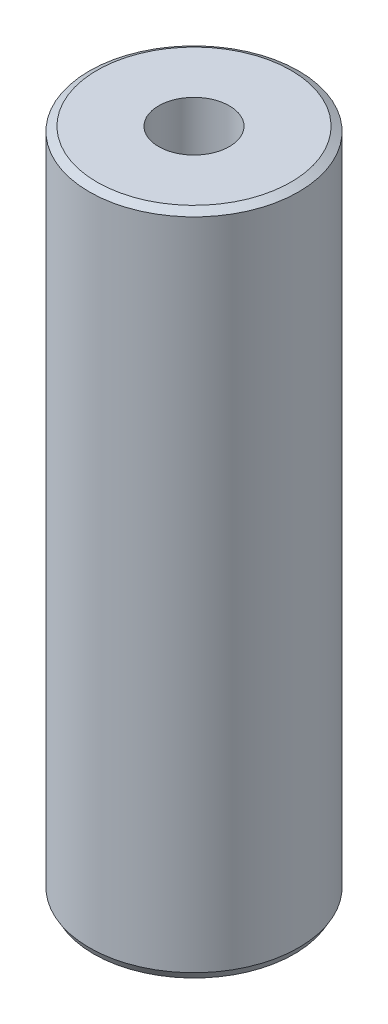
ISO-10303-21;
HEADER;
FILE_DESCRIPTION(('STEP AP214'),'2;1');
FILE_NAME('part.step','',(''),(''),'','','');
FILE_SCHEMA(('AUTOMOTIVE_DESIGN { 1 0 10303 214 1 1 1 1 }'));
ENDSEC;
DATA;
#1=APPLICATION_CONTEXT('core data for automotive mechanical design processes');
#2=APPLICATION_PROTOCOL_DEFINITION('international standard','automotive_design',2000,#1);
#3=PRODUCT_CONTEXT('',#1,'mechanical');
#4=PRODUCT('Part','Part','',(#3));
#5=PRODUCT_RELATED_PRODUCT_CATEGORY('part','',(#4));
#6=PRODUCT_DEFINITION_FORMATION('','',#4);
#7=PRODUCT_DEFINITION_CONTEXT('part definition',#1,'design');
#8=PRODUCT_DEFINITION('design','',#6,#7);
#9=PRODUCT_DEFINITION_SHAPE('','',#8);
#10=(LENGTH_UNIT() NAMED_UNIT(*) SI_UNIT(.MILLI.,.METRE.));
#11=(NAMED_UNIT(*) PLANE_ANGLE_UNIT() SI_UNIT($,.RADIAN.));
#12=(NAMED_UNIT(*) SI_UNIT($,.STERADIAN.) SOLID_ANGLE_UNIT());
#13=UNCERTAINTY_MEASURE_WITH_UNIT(LENGTH_MEASURE(1.E-05),#10,'distance_accuracy_value','');
#14=(GEOMETRIC_REPRESENTATION_CONTEXT(3) GLOBAL_UNCERTAINTY_ASSIGNED_CONTEXT((#13)) GLOBAL_UNIT_ASSIGNED_CONTEXT((#10,
#11,#12)) REPRESENTATION_CONTEXT('',''));
#15=CARTESIAN_POINT('',(0.,0.,0.));
#16=DIRECTION('',(0.,0.,1.));
#17=DIRECTION('',(1.,0.,0.));
#18=AXIS2_PLACEMENT_3D('',#15,#16,#17);
#19=CARTESIAN_POINT('',(0.,159.181617189433,0.));
#20=DIRECTION('',(0.,-1.,0.));
#21=DIRECTION('',(0.,0.,-1.));
#22=AXIS2_PLACEMENT_3D('',#19,#20,#21);
#23=CYLINDRICAL_SURFACE('',#22,25.);
#24=CARTESIAN_POINT('',(0.,158.108728389863,0.));
#25=DIRECTION('',(0.,1.,0.));
#26=DIRECTION('',(0.,0.,1.));
#27=AXIS2_PLACEMENT_3D('',#24,#25,#26);
#28=CIRCLE('',#27,25.);
#29=CARTESIAN_POINT('',(0.,158.108728389863,25.));
#30=VERTEX_POINT('',#29);
#31=EDGE_CURVE('E50',#30,#30,#28,.F.);
#32=ORIENTED_EDGE('',*,*,#31,.T.);
#33=EDGE_LOOP('',(#32));
#34=FACE_BOUND('',#33,.T.);
#35=CARTESIAN_POINT('',(0.,1.85829791172712,0.));
#36=DIRECTION('',(0.,1.,0.));
#37=DIRECTION('',(0.,0.,1.));
#38=AXIS2_PLACEMENT_3D('',#35,#36,#37);
#39=CIRCLE('',#38,25.);
#40=CARTESIAN_POINT('',(0.,1.85829791172712,25.));
#41=VERTEX_POINT('',#40);
#42=EDGE_CURVE('E51',#41,#41,#39,.T.);
#43=ORIENTED_EDGE('',*,*,#42,.T.);
#44=EDGE_LOOP('',(#43));
#45=FACE_BOUND('',#44,.T.);
#46=ADVANCED_FACE('F39',(#34,#45),#23,.T.);
#47=CARTESIAN_POINT('',(0.,159.181617189433,0.));
#48=DIRECTION('',(0.,1.,0.));
#49=DIRECTION('',(0.,0.,1.));
#50=AXIS2_PLACEMENT_3D('',#47,#48,#49);
#51=PLANE('',#50);
#52=CARTESIAN_POINT('',(0.,159.181617189433,0.));
#53=DIRECTION('',(0.,1.,0.));
#54=DIRECTION('',(0.,0.,1.));
#55=AXIS2_PLACEMENT_3D('',#52,#53,#54);
#56=CIRCLE('',#55,23.1417020882728);
#57=CARTESIAN_POINT('',(0.,159.181617189433,23.1417020882728));
#58=VERTEX_POINT('',#57);
#59=EDGE_CURVE('E54',#58,#58,#56,.T.);
#60=ORIENTED_EDGE('',*,*,#59,.T.);
#61=EDGE_LOOP('',(#60));
#62=FACE_BOUND('',#61,.T.);
#63=CARTESIAN_POINT('',(0.,159.181617189433,0.));
#64=DIRECTION('',(0.,1.,0.));
#65=DIRECTION('',(0.,0.,1.));
#66=AXIS2_PLACEMENT_3D('',#63,#64,#65);
#67=CIRCLE('',#66,8.44593921318451);
#68=CARTESIAN_POINT('',(0.,159.181617189433,8.44593921318451));
#69=VERTEX_POINT('',#68);
#70=EDGE_CURVE('E58',#69,#69,#67,.T.);
#71=ORIENTED_EDGE('',*,*,#70,.F.);
#72=EDGE_LOOP('',(#71));
#73=FACE_BOUND('',#72,.T.);
#74=ADVANCED_FACE('F69',(#62,#73),#51,.T.);
#75=CARTESIAN_POINT('',(0.,0.,0.));
#76=DIRECTION('',(0.,1.,0.));
#77=DIRECTION('',(0.,0.,1.));
#78=AXIS2_PLACEMENT_3D('',#75,#76,#77);
#79=PLANE('',#78);
#80=CARTESIAN_POINT('',(0.,0.,0.));
#81=DIRECTION('',(0.,1.,0.));
#82=DIRECTION('',(0.,0.,1.));
#83=AXIS2_PLACEMENT_3D('',#80,#81,#82);
#84=CIRCLE('',#83,23.9271112004298);
#85=CARTESIAN_POINT('',(0.,0.,23.9271112004298));
#86=VERTEX_POINT('',#85);
#87=EDGE_CURVE('E10',#86,#86,#84,.F.);
#88=ORIENTED_EDGE('',*,*,#87,.T.);
#89=EDGE_LOOP('',(#88));
#90=FACE_BOUND('',#89,.T.);
#91=CARTESIAN_POINT('',(0.,0.,0.));
#92=DIRECTION('',(0.,1.,0.));
#93=DIRECTION('',(0.,0.,1.));
#94=AXIS2_PLACEMENT_3D('',#91,#92,#93);
#95=CIRCLE('',#94,8.44593921318451);
#96=CARTESIAN_POINT('',(0.,0.,8.44593921318451));
#97=VERTEX_POINT('',#96);
#98=EDGE_CURVE('E63',#97,#97,#95,.T.);
#99=ORIENTED_EDGE('',*,*,#98,.T.);
#100=EDGE_LOOP('',(#99));
#101=FACE_BOUND('',#100,.T.);
#102=ADVANCED_FACE('F75',(#90,#101),#79,.F.);
#103=CARTESIAN_POINT('',(0.,159.181617189433,0.));
#104=DIRECTION('',(0.,-1.,0.));
#105=DIRECTION('',(0.,0.,-1.));
#106=AXIS2_PLACEMENT_3D('',#103,#104,#105);
#107=CYLINDRICAL_SURFACE('',#106,8.44593921318451);
#108=ORIENTED_EDGE('',*,*,#70,.T.);
#109=EDGE_LOOP('',(#108));
#110=FACE_BOUND('',#109,.T.);
#111=ORIENTED_EDGE('',*,*,#98,.F.);
#112=EDGE_LOOP('',(#111));
#113=FACE_BOUND('',#112,.T.);
#114=ADVANCED_FACE('F70',(#110,#113),#107,.F.);
#115=CARTESIAN_POINT('',(0.,159.181617189433,0.));
#116=DIRECTION('',(0.,-1.,0.));
#117=DIRECTION('',(0.,0.,-1.));
#118=AXIS2_PLACEMENT_3D('',#115,#116,#117);
#119=CONICAL_SURFACE('',#118,23.1417020882728,1.0471975511966);
#120=ORIENTED_EDGE('',*,*,#31,.F.);
#121=EDGE_LOOP('',(#120));
#122=FACE_BOUND('',#121,.T.);
#123=ORIENTED_EDGE('',*,*,#59,.F.);
#124=EDGE_LOOP('',(#123));
#125=FACE_BOUND('',#124,.T.);
#126=ADVANCED_FACE('F81',(#122,#125),#119,.T.);
#127=CARTESIAN_POINT('',(0.,1.85829791172712,0.));
#128=DIRECTION('',(0.,1.,0.));
#129=DIRECTION('',(0.,0.,1.));
#130=AXIS2_PLACEMENT_3D('',#127,#128,#129);
#131=CONICAL_SURFACE('',#130,25.,0.5235987755983);
#132=ORIENTED_EDGE('',*,*,#87,.F.);
#133=EDGE_LOOP('',(#132));
#134=FACE_BOUND('',#133,.T.);
#135=ORIENTED_EDGE('',*,*,#42,.F.);
#136=EDGE_LOOP('',(#135));
#137=FACE_BOUND('',#136,.T.);
#138=ADVANCED_FACE('F45',(#134,#137),#131,.T.);
#139=CLOSED_SHELL('',(#46,#74,#102,#114,#126,#138));
#140=MANIFOLD_SOLID_BREP('B2',#139);
#141=ADVANCED_BREP_SHAPE_REPRESENTATION('',(#18,#140),#14);
#142=SHAPE_DEFINITION_REPRESENTATION(#9,#141);
ENDSEC;
END-ISO-10303-21;
